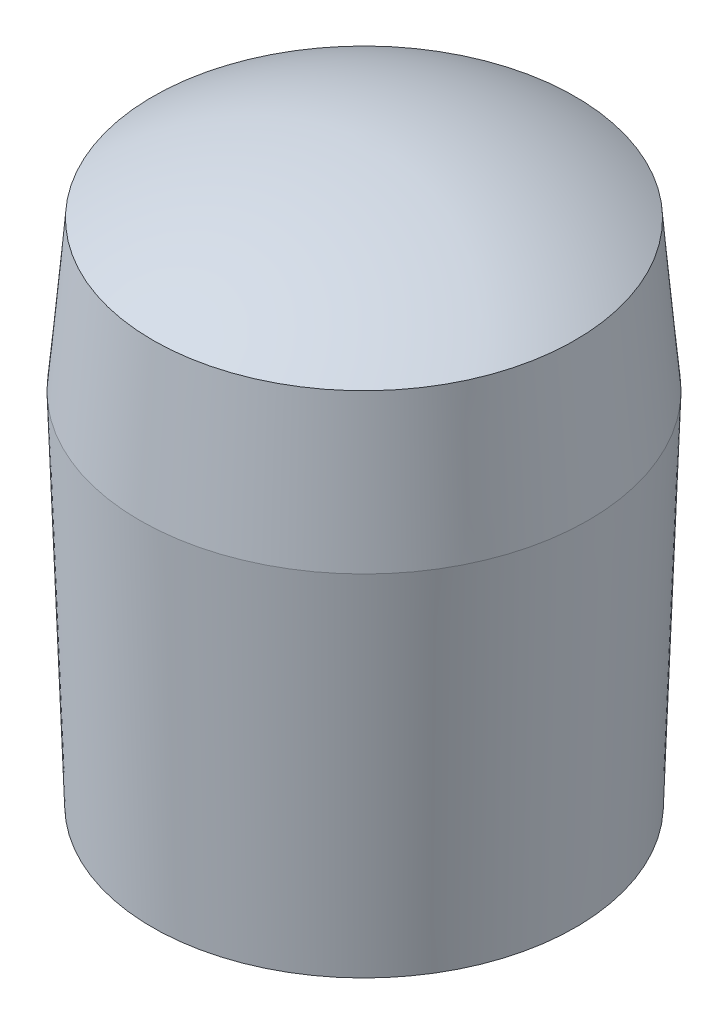
ISO-10303-21;
HEADER;
FILE_DESCRIPTION(('STEP AP214'),'2;1');
FILE_NAME('part.step','',(''),(''),'','','');
FILE_SCHEMA(('AUTOMOTIVE_DESIGN { 1 0 10303 214 1 1 1 1 }'));
ENDSEC;
DATA;
#1=APPLICATION_CONTEXT('core data for automotive mechanical design processes');
#2=APPLICATION_PROTOCOL_DEFINITION('international standard','automotive_design',2000,#1);
#3=PRODUCT_CONTEXT('',#1,'mechanical');
#4=PRODUCT('Part','Part','',(#3));
#5=PRODUCT_RELATED_PRODUCT_CATEGORY('part','',(#4));
#6=PRODUCT_DEFINITION_FORMATION('','',#4);
#7=PRODUCT_DEFINITION_CONTEXT('part definition',#1,'design');
#8=PRODUCT_DEFINITION('design','',#6,#7);
#9=PRODUCT_DEFINITION_SHAPE('','',#8);
#10=(LENGTH_UNIT() NAMED_UNIT(*) SI_UNIT(.MILLI.,.METRE.));
#11=(NAMED_UNIT(*) PLANE_ANGLE_UNIT() SI_UNIT($,.RADIAN.));
#12=(NAMED_UNIT(*) SI_UNIT($,.STERADIAN.) SOLID_ANGLE_UNIT());
#13=UNCERTAINTY_MEASURE_WITH_UNIT(LENGTH_MEASURE(1.E-05),#10,'distance_accuracy_value','');
#14=(GEOMETRIC_REPRESENTATION_CONTEXT(3) GLOBAL_UNCERTAINTY_ASSIGNED_CONTEXT((#13)) GLOBAL_UNIT_ASSIGNED_CONTEXT((#10,
#11,#12)) REPRESENTATION_CONTEXT('',''));
#15=CARTESIAN_POINT('',(0.,0.,0.));
#16=DIRECTION('',(0.,0.,1.));
#17=DIRECTION('',(1.,0.,0.));
#18=AXIS2_PLACEMENT_3D('',#15,#16,#17);
#19=CARTESIAN_POINT('',(0.,0.,0.));
#20=DIRECTION('',(0.,-1.,0.));
#21=DIRECTION('',(0.,0.,1.));
#22=AXIS2_PLACEMENT_3D('',#19,#20,#21);
#23=CONICAL_SURFACE('',#22,0.75,0.0872664625997165);
#24=CARTESIAN_POINT('',(0.,0.5,0.));
#25=DIRECTION('',(0.,1.,0.));
#26=DIRECTION('',(0.,0.,1.));
#27=AXIS2_PLACEMENT_3D('',#24,#25,#26);
#28=CIRCLE('',#27,0.706255668237038);
#29=CARTESIAN_POINT('',(0.,0.5,0.706255668237038));
#30=VERTEX_POINT('',#29);
#31=EDGE_CURVE('E10',#30,#30,#28,.T.);
#32=ORIENTED_EDGE('',*,*,#31,.F.);
#33=EDGE_LOOP('',(#32));
#34=FACE_BOUND('',#33,.T.);
#35=CARTESIAN_POINT('',(0.,0.,0.));
#36=DIRECTION('',(0.,-1.,0.));
#37=DIRECTION('',(0.,0.,-1.));
#38=AXIS2_PLACEMENT_3D('',#35,#36,#37);
#39=CIRCLE('',#38,0.75);
#40=CARTESIAN_POINT('',(0.,0.,-0.75));
#41=VERTEX_POINT('',#40);
#42=EDGE_CURVE('E50',#41,#41,#39,.T.);
#43=ORIENTED_EDGE('',*,*,#42,.F.);
#44=EDGE_LOOP('',(#43));
#45=FACE_BOUND('',#44,.T.);
#46=ADVANCED_FACE('F37',(#34,#45),#23,.T.);
#47=CARTESIAN_POINT('',(0.,-0.646992672292363,0.));
#48=DIRECTION('',(0.,0.,1.));
#49=DIRECTION('',(1.,0.,0.));
#50=AXIS2_PLACEMENT_3D('',#47,#48,#49);
#51=SPHERICAL_SURFACE('',#50,1.34699267229236);
#52=CARTESIAN_POINT('',(0.,-0.646992672292363,0.));
#53=DIRECTION('',(0.,1.,0.));
#54=DIRECTION('',(0.,0.,1.));
#55=AXIS2_PLACEMENT_3D('',#52,#53,#54);
#56=SPHERICAL_SURFACE('',#55,1.34699267229236);
#57=ORIENTED_EDGE('',*,*,#31,.T.);
#58=EDGE_LOOP('',(#57));
#59=FACE_BOUND('',#58,.T.);
#60=ADVANCED_FACE('F59',(#59),#56,.T.);
#61=CARTESIAN_POINT('',(0.,0.,0.));
#62=DIRECTION('',(0.,1.,0.));
#63=DIRECTION('',(0.,0.,-1.));
#64=AXIS2_PLACEMENT_3D('',#61,#62,#63);
#65=CONICAL_SURFACE('',#64,0.75,0.0349065850398866);
#66=CARTESIAN_POINT('',(0.,-1.2,0.));
#67=DIRECTION('',(0.,-1.,0.));
#68=DIRECTION('',(0.,0.,-1.));
#69=AXIS2_PLACEMENT_3D('',#66,#67,#68);
#70=CIRCLE('',#69,0.708095076609903);
#71=CARTESIAN_POINT('',(0.,-1.2,-0.708095076609903));
#72=VERTEX_POINT('',#71);
#73=EDGE_CURVE('E41',#72,#72,#70,.T.);
#74=ORIENTED_EDGE('',*,*,#73,.F.);
#75=EDGE_LOOP('',(#74));
#76=FACE_BOUND('',#75,.T.);
#77=ORIENTED_EDGE('',*,*,#42,.T.);
#78=EDGE_LOOP('',(#77));
#79=FACE_BOUND('',#78,.T.);
#80=ADVANCED_FACE('F56',(#76,#79),#65,.T.);
#81=CARTESIAN_POINT('',(0.,-0.0465034062020399,0.));
#82=DIRECTION('',(0.,0.,1.));
#83=DIRECTION('',(1.,0.,0.));
#84=AXIS2_PLACEMENT_3D('',#81,#82,#83);
#85=SPHERICAL_SURFACE('',#84,1.35349659379796);
#86=CARTESIAN_POINT('',(0.,-0.0465034062020399,0.));
#87=DIRECTION('',(0.,-1.,0.));
#88=DIRECTION('',(0.,0.,-1.));
#89=AXIS2_PLACEMENT_3D('',#86,#87,#88);
#90=SPHERICAL_SURFACE('',#89,1.35349659379796);
#91=ORIENTED_EDGE('',*,*,#73,.T.);
#92=EDGE_LOOP('',(#91));
#93=FACE_BOUND('',#92,.T.);
#94=ADVANCED_FACE('F39',(#93),#90,.T.);
#95=CLOSED_SHELL('',(#46,#60,#80,#94));
#96=MANIFOLD_SOLID_BREP('B2',#95);
#97=ADVANCED_BREP_SHAPE_REPRESENTATION('',(#18,#96),#14);
#98=SHAPE_DEFINITION_REPRESENTATION(#9,#97);
ENDSEC;
END-ISO-10303-21;
